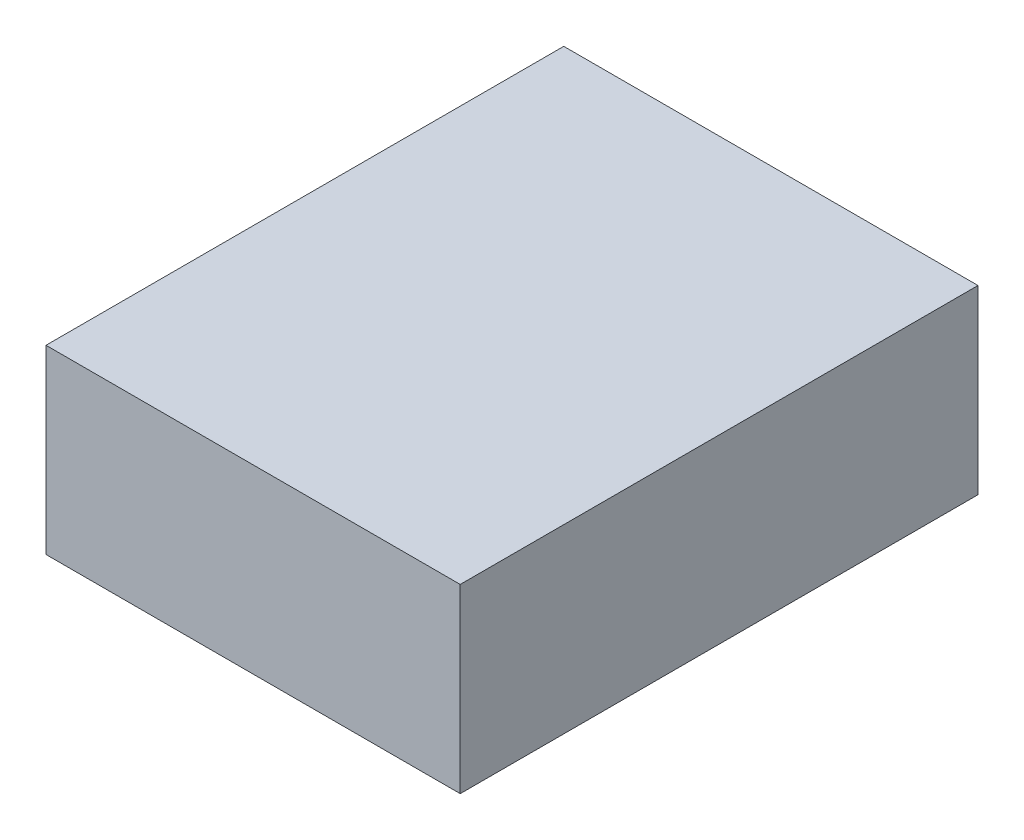
ISO-10303-21;
HEADER;
FILE_DESCRIPTION(('STEP AP214'),'2;1');
FILE_NAME('part.step','',(''),(''),'','','');
FILE_SCHEMA(('AUTOMOTIVE_DESIGN { 1 0 10303 214 1 1 1 1 }'));
ENDSEC;
DATA;
#1=APPLICATION_CONTEXT('core data for automotive mechanical design processes');
#2=APPLICATION_PROTOCOL_DEFINITION('international standard','automotive_design',2000,#1);
#3=PRODUCT_CONTEXT('',#1,'mechanical');
#4=PRODUCT('Part','Part','',(#3));
#5=PRODUCT_RELATED_PRODUCT_CATEGORY('part','',(#4));
#6=PRODUCT_DEFINITION_FORMATION('','',#4);
#7=PRODUCT_DEFINITION_CONTEXT('part definition',#1,'design');
#8=PRODUCT_DEFINITION('design','',#6,#7);
#9=PRODUCT_DEFINITION_SHAPE('','',#8);
#10=(LENGTH_UNIT() NAMED_UNIT(*) SI_UNIT(.MILLI.,.METRE.));
#11=(NAMED_UNIT(*) PLANE_ANGLE_UNIT() SI_UNIT($,.RADIAN.));
#12=(NAMED_UNIT(*) SI_UNIT($,.STERADIAN.) SOLID_ANGLE_UNIT());
#13=UNCERTAINTY_MEASURE_WITH_UNIT(LENGTH_MEASURE(1.E-05),#10,'distance_accuracy_value','');
#14=(GEOMETRIC_REPRESENTATION_CONTEXT(3) GLOBAL_UNCERTAINTY_ASSIGNED_CONTEXT((#13)) GLOBAL_UNIT_ASSIGNED_CONTEXT((#10,
#11,#12)) REPRESENTATION_CONTEXT('',''));
#15=CARTESIAN_POINT('',(0.,0.,0.));
#16=DIRECTION('',(0.,0.,1.));
#17=DIRECTION('',(1.,0.,0.));
#18=AXIS2_PLACEMENT_3D('',#15,#16,#17);
#19=CARTESIAN_POINT('',(-40.,35.,-50.));
#20=DIRECTION('',(1.,0.,0.));
#21=DIRECTION('',(0.,0.,-1.));
#22=AXIS2_PLACEMENT_3D('',#19,#20,#21);
#23=PLANE('',#22);
#24=DIRECTION('',(0.,0.,1.));
#25=VECTOR('',#24,1.);
#26=CARTESIAN_POINT('',(-40.,0.,-50.));
#27=LINE('',#26,#25);
#28=CARTESIAN_POINT('',(-40.,0.,-50.));
#29=VERTEX_POINT('',#28);
#30=CARTESIAN_POINT('',(-40.,0.,50.));
#31=VERTEX_POINT('',#30);
#32=EDGE_CURVE('E97',#29,#31,#27,.T.);
#33=ORIENTED_EDGE('',*,*,#32,.T.);
#34=DIRECTION('',(0.,-1.,0.));
#35=VECTOR('',#34,1.);
#36=CARTESIAN_POINT('',(-40.,35.,50.));
#37=LINE('',#36,#35);
#38=CARTESIAN_POINT('',(-40.,35.,50.));
#39=VERTEX_POINT('',#38);
#40=EDGE_CURVE('E11',#39,#31,#37,.T.);
#41=ORIENTED_EDGE('',*,*,#40,.F.);
#42=DIRECTION('',(0.,0.,1.));
#43=VECTOR('',#42,1.);
#44=CARTESIAN_POINT('',(-40.,35.,-50.));
#45=LINE('',#44,#43);
#46=CARTESIAN_POINT('',(-40.,35.,-50.));
#47=VERTEX_POINT('',#46);
#48=EDGE_CURVE('E85',#47,#39,#45,.T.);
#49=ORIENTED_EDGE('',*,*,#48,.F.);
#50=DIRECTION('',(0.,-1.,0.));
#51=VECTOR('',#50,1.);
#52=CARTESIAN_POINT('',(-40.,35.,-50.));
#53=LINE('',#52,#51);
#54=EDGE_CURVE('E93',#47,#29,#53,.T.);
#55=ORIENTED_EDGE('',*,*,#54,.T.);
#56=EDGE_LOOP('',(#33,#41,#49,#55));
#57=FACE_BOUND('',#56,.T.);
#58=ADVANCED_FACE('F34',(#57),#23,.F.);
#59=CARTESIAN_POINT('',(-40.,35.,50.));
#60=DIRECTION('',(0.,0.,-1.));
#61=DIRECTION('',(-1.,0.,0.));
#62=AXIS2_PLACEMENT_3D('',#59,#60,#61);
#63=PLANE('',#62);
#64=DIRECTION('',(1.,0.,0.));
#65=VECTOR('',#64,1.);
#66=CARTESIAN_POINT('',(-40.,0.,50.));
#67=LINE('',#66,#65);
#68=CARTESIAN_POINT('',(40.,0.,50.));
#69=VERTEX_POINT('',#68);
#70=EDGE_CURVE('E89',#31,#69,#67,.T.);
#71=ORIENTED_EDGE('',*,*,#70,.T.);
#72=DIRECTION('',(0.,-1.,0.));
#73=VECTOR('',#72,1.);
#74=CARTESIAN_POINT('',(40.,35.,50.));
#75=LINE('',#74,#73);
#76=CARTESIAN_POINT('',(40.,35.,50.));
#77=VERTEX_POINT('',#76);
#78=EDGE_CURVE('E42',#77,#69,#75,.T.);
#79=ORIENTED_EDGE('',*,*,#78,.F.);
#80=DIRECTION('',(1.,0.,0.));
#81=VECTOR('',#80,1.);
#82=CARTESIAN_POINT('',(-40.,35.,50.));
#83=LINE('',#82,#81);
#84=EDGE_CURVE('E80',#39,#77,#83,.T.);
#85=ORIENTED_EDGE('',*,*,#84,.F.);
#86=ORIENTED_EDGE('',*,*,#40,.T.);
#87=EDGE_LOOP('',(#71,#79,#85,#86));
#88=FACE_BOUND('',#87,.T.);
#89=ADVANCED_FACE('F88',(#88),#63,.F.);
#90=CARTESIAN_POINT('',(40.,35.,-50.));
#91=DIRECTION('',(-1.,0.,0.));
#92=DIRECTION('',(0.,0.,1.));
#93=AXIS2_PLACEMENT_3D('',#90,#91,#92);
#94=PLANE('',#93);
#95=DIRECTION('',(0.,0.,-1.));
#96=VECTOR('',#95,1.);
#97=CARTESIAN_POINT('',(40.,0.,-50.));
#98=LINE('',#97,#96);
#99=CARTESIAN_POINT('',(40.,0.,-50.));
#100=VERTEX_POINT('',#99);
#101=EDGE_CURVE('E67',#69,#100,#98,.T.);
#102=ORIENTED_EDGE('',*,*,#101,.T.);
#103=DIRECTION('',(0.,-1.,0.));
#104=VECTOR('',#103,1.);
#105=CARTESIAN_POINT('',(40.,35.,-50.));
#106=LINE('',#105,#104);
#107=CARTESIAN_POINT('',(40.,35.,-50.));
#108=VERTEX_POINT('',#107);
#109=EDGE_CURVE('E90',#108,#100,#106,.T.);
#110=ORIENTED_EDGE('',*,*,#109,.F.);
#111=DIRECTION('',(0.,0.,-1.));
#112=VECTOR('',#111,1.);
#113=CARTESIAN_POINT('',(40.,35.,-50.));
#114=LINE('',#113,#112);
#115=EDGE_CURVE('E83',#77,#108,#114,.T.);
#116=ORIENTED_EDGE('',*,*,#115,.F.);
#117=ORIENTED_EDGE('',*,*,#78,.T.);
#118=EDGE_LOOP('',(#102,#110,#116,#117));
#119=FACE_BOUND('',#118,.T.);
#120=ADVANCED_FACE('F91',(#119),#94,.F.);
#121=CARTESIAN_POINT('',(-40.,35.,-50.));
#122=DIRECTION('',(0.,0.,1.));
#123=DIRECTION('',(1.,0.,0.));
#124=AXIS2_PLACEMENT_3D('',#121,#122,#123);
#125=PLANE('',#124);
#126=DIRECTION('',(-1.,0.,0.));
#127=VECTOR('',#126,1.);
#128=CARTESIAN_POINT('',(-40.,0.,-50.));
#129=LINE('',#128,#127);
#130=EDGE_CURVE('E73',#100,#29,#129,.T.);
#131=ORIENTED_EDGE('',*,*,#130,.T.);
#132=ORIENTED_EDGE('',*,*,#54,.F.);
#133=DIRECTION('',(-1.,0.,0.));
#134=VECTOR('',#133,1.);
#135=CARTESIAN_POINT('',(-40.,35.,-50.));
#136=LINE('',#135,#134);
#137=EDGE_CURVE('E50',#108,#47,#136,.T.);
#138=ORIENTED_EDGE('',*,*,#137,.F.);
#139=ORIENTED_EDGE('',*,*,#109,.T.);
#140=EDGE_LOOP('',(#131,#132,#138,#139));
#141=FACE_BOUND('',#140,.T.);
#142=ADVANCED_FACE('F104',(#141),#125,.F.);
#143=CARTESIAN_POINT('',(0.,35.,0.));
#144=DIRECTION('',(0.,1.,0.));
#145=DIRECTION('',(0.,0.,1.));
#146=AXIS2_PLACEMENT_3D('',#143,#144,#145);
#147=PLANE('',#146);
#148=ORIENTED_EDGE('',*,*,#48,.T.);
#149=ORIENTED_EDGE('',*,*,#84,.T.);
#150=ORIENTED_EDGE('',*,*,#115,.T.);
#151=ORIENTED_EDGE('',*,*,#137,.T.);
#152=EDGE_LOOP('',(#148,#149,#150,#151));
#153=FACE_BOUND('',#152,.T.);
#154=ADVANCED_FACE('F81',(#153),#147,.T.);
#155=CARTESIAN_POINT('',(0.,0.,0.));
#156=DIRECTION('',(0.,1.,0.));
#157=DIRECTION('',(0.,0.,1.));
#158=AXIS2_PLACEMENT_3D('',#155,#156,#157);
#159=PLANE('',#158);
#160=ORIENTED_EDGE('',*,*,#32,.F.);
#161=ORIENTED_EDGE('',*,*,#130,.F.);
#162=ORIENTED_EDGE('',*,*,#101,.F.);
#163=ORIENTED_EDGE('',*,*,#70,.F.);
#164=EDGE_LOOP('',(#160,#161,#162,#163));
#165=FACE_BOUND('',#164,.T.);
#166=ADVANCED_FACE('F107',(#165),#159,.F.);
#167=CLOSED_SHELL('',(#58,#89,#120,#142,#154,#166));
#168=MANIFOLD_SOLID_BREP('B2',#167);
#169=ADVANCED_BREP_SHAPE_REPRESENTATION('',(#18,#168),#14);
#170=SHAPE_DEFINITION_REPRESENTATION(#9,#169);
ENDSEC;
END-ISO-10303-21;
